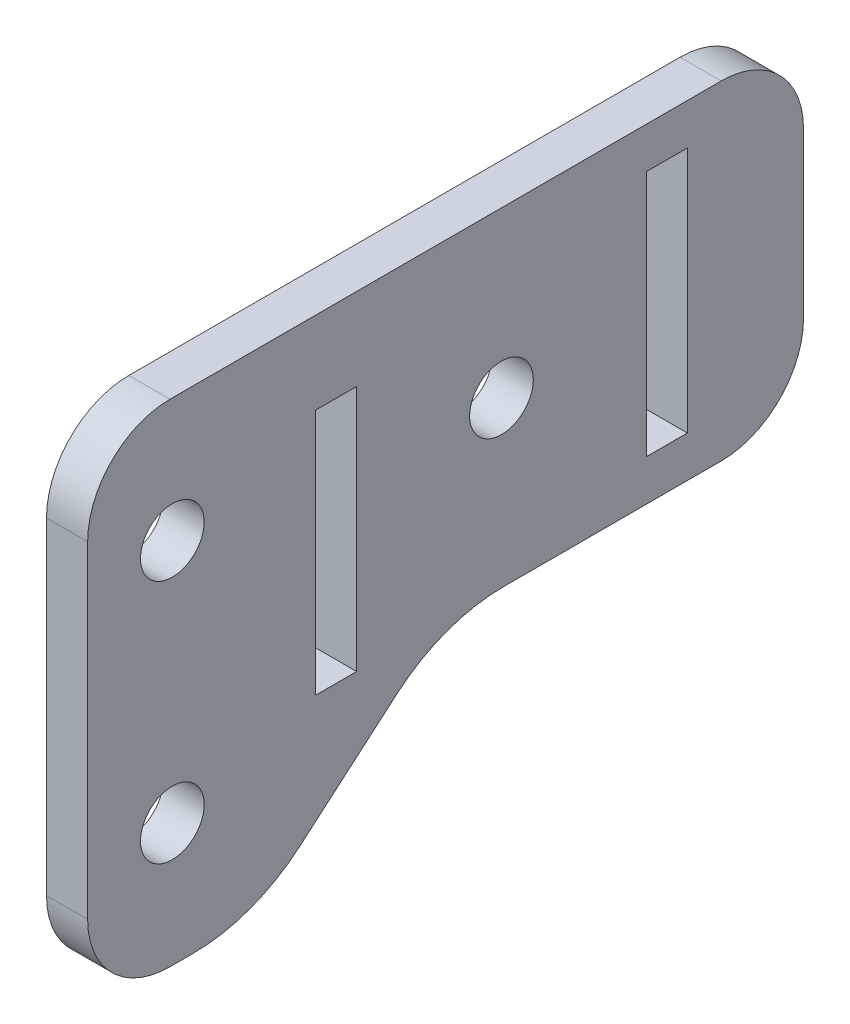
ISO-10303-21;
HEADER;
FILE_DESCRIPTION(('STEP AP214'),'2;1');
FILE_NAME('part.step','',(''),(''),'','','');
FILE_SCHEMA(('AUTOMOTIVE_DESIGN { 1 0 10303 214 1 1 1 1 }'));
ENDSEC;
DATA;
#1=APPLICATION_CONTEXT('core data for automotive mechanical design processes');
#2=APPLICATION_PROTOCOL_DEFINITION('international standard','automotive_design',2000,#1);
#3=PRODUCT_CONTEXT('',#1,'mechanical');
#4=PRODUCT('Part','Part','',(#3));
#5=PRODUCT_RELATED_PRODUCT_CATEGORY('part','',(#4));
#6=PRODUCT_DEFINITION_FORMATION('','',#4);
#7=PRODUCT_DEFINITION_CONTEXT('part definition',#1,'design');
#8=PRODUCT_DEFINITION('design','',#6,#7);
#9=PRODUCT_DEFINITION_SHAPE('','',#8);
#10=(LENGTH_UNIT() NAMED_UNIT(*) SI_UNIT(.MILLI.,.METRE.));
#11=(NAMED_UNIT(*) PLANE_ANGLE_UNIT() SI_UNIT($,.RADIAN.));
#12=(NAMED_UNIT(*) SI_UNIT($,.STERADIAN.) SOLID_ANGLE_UNIT());
#13=UNCERTAINTY_MEASURE_WITH_UNIT(LENGTH_MEASURE(1.E-05),#10,'distance_accuracy_value','');
#14=(GEOMETRIC_REPRESENTATION_CONTEXT(3) GLOBAL_UNCERTAINTY_ASSIGNED_CONTEXT((#13)) GLOBAL_UNIT_ASSIGNED_CONTEXT((#10,
#11,#12)) REPRESENTATION_CONTEXT('',''));
#15=CARTESIAN_POINT('',(0.,0.,0.));
#16=DIRECTION('',(0.,0.,1.));
#17=DIRECTION('',(1.,0.,0.));
#18=AXIS2_PLACEMENT_3D('',#15,#16,#17);
#19=CARTESIAN_POINT('',(3.175,17.2156788351446,31.9348602919418));
#20=DIRECTION('',(0.,0.,-1.));
#21=DIRECTION('',(0.,1.,0.));
#22=AXIS2_PLACEMENT_3D('',#19,#20,#21);
#23=PLANE('',#22);
#24=DIRECTION('',(0.,-1.,0.));
#25=VECTOR('',#24,1.);
#26=CARTESIAN_POINT('',(0.,17.2156788351446,31.9348602919418));
#27=LINE('',#26,#25);
#28=CARTESIAN_POINT('',(0.,10.8656788351446,31.9348602919418));
#29=VERTEX_POINT('',#28);
#30=CARTESIAN_POINT('',(0.,-14.3666811648554,31.9348602919418));
#31=VERTEX_POINT('',#30);
#32=EDGE_CURVE('E218',#29,#31,#27,.T.);
#33=ORIENTED_EDGE('',*,*,#32,.T.);
#34=DIRECTION('',(-1.,0.,0.));
#35=VECTOR('',#34,1.);
#36=CARTESIAN_POINT('',(3.175,-14.3666811648554,31.9348602919418));
#37=LINE('',#36,#35);
#38=CARTESIAN_POINT('',(3.175,-14.3666811648554,31.9348602919418));
#39=VERTEX_POINT('',#38);
#40=EDGE_CURVE('E11',#31,#39,#37,.F.);
#41=ORIENTED_EDGE('',*,*,#40,.T.);
#42=DIRECTION('',(0.,-1.,0.));
#43=VECTOR('',#42,1.);
#44=CARTESIAN_POINT('',(3.175,17.2156788351446,31.9348602919418));
#45=LINE('',#44,#43);
#46=CARTESIAN_POINT('',(3.175,10.8656788351446,31.9348602919418));
#47=VERTEX_POINT('',#46);
#48=EDGE_CURVE('E253',#47,#39,#45,.T.);
#49=ORIENTED_EDGE('',*,*,#48,.F.);
#50=DIRECTION('',(-1.,0.,0.));
#51=VECTOR('',#50,1.);
#52=CARTESIAN_POINT('',(3.175,10.8656788351446,31.9348602919418));
#53=LINE('',#52,#51);
#54=EDGE_CURVE('E43',#47,#29,#53,.T.);
#55=ORIENTED_EDGE('',*,*,#54,.T.);
#56=EDGE_LOOP('',(#33,#41,#49,#55));
#57=FACE_BOUND('',#56,.T.);
#58=ADVANCED_FACE('F35',(#57),#23,.F.);
#59=CARTESIAN_POINT('',(3.175,-20.7166811648554,23.8154632165909));
#60=DIRECTION('',(0.,1.,0.));
#61=DIRECTION('',(0.,0.,1.));
#62=AXIS2_PLACEMENT_3D('',#59,#60,#61);
#63=PLANE('',#62);
#64=DIRECTION('',(0.,0.,-1.));
#65=VECTOR('',#64,1.);
#66=CARTESIAN_POINT('',(3.175,-20.7166811648554,23.8154632165909));
#67=LINE('',#66,#65);
#68=CARTESIAN_POINT('',(3.175,-20.7166811648554,25.5848602919418));
#69=VERTEX_POINT('',#68);
#70=CARTESIAN_POINT('',(3.175,-20.7166811648554,23.8154632165909));
#71=VERTEX_POINT('',#70);
#72=EDGE_CURVE('E255',#69,#71,#67,.T.);
#73=ORIENTED_EDGE('',*,*,#72,.F.);
#74=DIRECTION('',(-1.,0.,0.));
#75=VECTOR('',#74,1.);
#76=CARTESIAN_POINT('',(3.175,-20.7166811648554,25.5848602919418));
#77=LINE('',#76,#75);
#78=CARTESIAN_POINT('',(0.,-20.7166811648554,25.5848602919418));
#79=VERTEX_POINT('',#78);
#80=EDGE_CURVE('E327',#69,#79,#77,.T.);
#81=ORIENTED_EDGE('',*,*,#80,.T.);
#82=DIRECTION('',(0.,0.,-1.));
#83=VECTOR('',#82,1.);
#84=CARTESIAN_POINT('',(0.,-20.7166811648554,23.8154632165909));
#85=LINE('',#84,#83);
#86=CARTESIAN_POINT('',(0.,-20.7166811648554,23.8154632165909));
#87=VERTEX_POINT('',#86);
#88=EDGE_CURVE('E275',#79,#87,#85,.T.);
#89=ORIENTED_EDGE('',*,*,#88,.T.);
#90=DIRECTION('',(-1.,0.,0.));
#91=VECTOR('',#90,1.);
#92=CARTESIAN_POINT('',(3.175,-20.7166811648554,23.8154632165909));
#93=LINE('',#92,#91);
#94=EDGE_CURVE('E298',#71,#87,#93,.T.);
#95=ORIENTED_EDGE('',*,*,#94,.F.);
#96=EDGE_LOOP('',(#73,#81,#89,#95));
#97=FACE_BOUND('',#96,.T.);
#98=ADVANCED_FACE('F346',(#97),#63,.F.);
#99=CARTESIAN_POINT('',(3.175,-8.01668116485543,23.8154632165909));
#100=DIRECTION('',(-1.,0.,0.));
#101=DIRECTION('',(0.,0.,1.));
#102=AXIS2_PLACEMENT_3D('',#99,#100,#101);
#103=CYLINDRICAL_SURFACE('',#102,12.7);
#104=CARTESIAN_POINT('',(0.,-8.01668116485543,23.8154632165909));
#105=DIRECTION('',(1.,0.,0.));
#106=DIRECTION('',(0.,0.,-1.));
#107=AXIS2_PLACEMENT_3D('',#104,#105,#106);
#108=CIRCLE('',#107,12.7);
#109=CARTESIAN_POINT('',(0.,-17.6547424695242,15.5451685248978));
#110=VERTEX_POINT('',#109);
#111=EDGE_CURVE('E277',#87,#110,#108,.T.);
#112=ORIENTED_EDGE('',*,*,#111,.T.);
#113=DIRECTION('',(-1.,0.,0.));
#114=VECTOR('',#113,1.);
#115=CARTESIAN_POINT('',(3.175,-17.6547424695242,15.5451685248978));
#116=LINE('',#115,#114);
#117=CARTESIAN_POINT('',(3.175,-17.6547424695242,15.5451685248978));
#118=VERTEX_POINT('',#117);
#119=EDGE_CURVE('E295',#118,#110,#116,.T.);
#120=ORIENTED_EDGE('',*,*,#119,.F.);
#121=CARTESIAN_POINT('',(3.175,-8.01668116485543,23.8154632165909));
#122=DIRECTION('',(1.,0.,0.));
#123=DIRECTION('',(0.,0.,-1.));
#124=AXIS2_PLACEMENT_3D('',#121,#122,#123);
#125=CIRCLE('',#124,12.7);
#126=EDGE_CURVE('E258',#71,#118,#125,.T.);
#127=ORIENTED_EDGE('',*,*,#126,.F.);
#128=ORIENTED_EDGE('',*,*,#94,.T.);
#129=EDGE_LOOP('',(#112,#120,#127,#128));
#130=FACE_BOUND('',#129,.T.);
#131=ADVANCED_FACE('F353',(#130),#103,.T.);
#132=CARTESIAN_POINT('',(3.175,-11.2462598601867,8.07683147510241));
#133=DIRECTION('',(0.,0.758902464934545,0.651204306432529));
#134=DIRECTION('',(0.,-0.651204306432529,0.758902464934545));
#135=AXIS2_PLACEMENT_3D('',#132,#133,#134);
#136=PLANE('',#135);
#137=DIRECTION('',(0.,0.651204306432529,-0.758902464934545));
#138=VECTOR('',#137,1.);
#139=CARTESIAN_POINT('',(0.,-11.2462598601867,8.07683147510241));
#140=LINE('',#139,#138);
#141=CARTESIAN_POINT('',(0.,-11.2462598601867,8.07683147510241));
#142=VERTEX_POINT('',#141);
#143=EDGE_CURVE('E279',#110,#142,#140,.T.);
#144=ORIENTED_EDGE('',*,*,#143,.T.);
#145=DIRECTION('',(-1.,0.,0.));
#146=VECTOR('',#145,1.);
#147=CARTESIAN_POINT('',(3.175,-11.2462598601867,8.07683147510241));
#148=LINE('',#147,#146);
#149=CARTESIAN_POINT('',(3.175,-11.2462598601867,8.07683147510241));
#150=VERTEX_POINT('',#149);
#151=EDGE_CURVE('E292',#150,#142,#148,.T.);
#152=ORIENTED_EDGE('',*,*,#151,.F.);
#153=DIRECTION('',(0.,0.651204306432529,-0.758902464934545));
#154=VECTOR('',#153,1.);
#155=CARTESIAN_POINT('',(3.175,-11.2462598601867,8.07683147510241));
#156=LINE('',#155,#154);
#157=EDGE_CURVE('E260',#118,#150,#156,.T.);
#158=ORIENTED_EDGE('',*,*,#157,.F.);
#159=ORIENTED_EDGE('',*,*,#119,.T.);
#160=EDGE_LOOP('',(#144,#152,#158,#159));
#161=FACE_BOUND('',#160,.T.);
#162=ADVANCED_FACE('F356',(#161),#136,.F.);
#163=CARTESIAN_POINT('',(3.175,-20.8843211648554,-0.193463216590709));
#164=DIRECTION('',(-1.,0.,0.));
#165=DIRECTION('',(0.,0.,1.));
#166=AXIS2_PLACEMENT_3D('',#163,#164,#165);
#167=CYLINDRICAL_SURFACE('',#166,12.7);
#168=CARTESIAN_POINT('',(0.,-20.8843211648554,-0.193463216590709));
#169=DIRECTION('',(-1.,0.,0.));
#170=DIRECTION('',(0.,0.,-1.));
#171=AXIS2_PLACEMENT_3D('',#168,#169,#170);
#172=CIRCLE('',#171,12.7);
#173=CARTESIAN_POINT('',(0.,-8.18432116485543,-0.193463216590736));
#174=VERTEX_POINT('',#173);
#175=EDGE_CURVE('E281',#142,#174,#172,.T.);
#176=ORIENTED_EDGE('',*,*,#175,.T.);
#177=DIRECTION('',(-1.,0.,0.));
#178=VECTOR('',#177,1.);
#179=CARTESIAN_POINT('',(3.175,-8.18432116485543,-0.193463216590736));
#180=LINE('',#179,#178);
#181=CARTESIAN_POINT('',(3.175,-8.18432116485543,-0.193463216590736));
#182=VERTEX_POINT('',#181);
#183=EDGE_CURVE('E272',#182,#174,#180,.T.);
#184=ORIENTED_EDGE('',*,*,#183,.F.);
#185=CARTESIAN_POINT('',(3.175,-20.8843211648554,-0.193463216590709));
#186=DIRECTION('',(-1.,0.,0.));
#187=DIRECTION('',(0.,0.,-1.));
#188=AXIS2_PLACEMENT_3D('',#185,#186,#187);
#189=CIRCLE('',#188,12.7);
#190=EDGE_CURVE('E262',#150,#182,#189,.T.);
#191=ORIENTED_EDGE('',*,*,#190,.F.);
#192=ORIENTED_EDGE('',*,*,#151,.T.);
#193=EDGE_LOOP('',(#176,#184,#191,#192));
#194=FACE_BOUND('',#193,.T.);
#195=ADVANCED_FACE('F361',(#194),#167,.F.);
#196=CARTESIAN_POINT('',(3.175,-8.18432116485543,-23.3101397080582));
#197=DIRECTION('',(0.,1.,0.));
#198=DIRECTION('',(0.,0.,1.));
#199=AXIS2_PLACEMENT_3D('',#196,#197,#198);
#200=PLANE('',#199);
#201=DIRECTION('',(0.,0.,-1.));
#202=VECTOR('',#201,1.);
#203=CARTESIAN_POINT('',(0.,-8.18432116485543,-23.3101397080582));
#204=LINE('',#203,#202);
#205=CARTESIAN_POINT('',(0.,-8.18432116485543,-16.9601397080582));
#206=VERTEX_POINT('',#205);
#207=EDGE_CURVE('E283',#174,#206,#204,.T.);
#208=ORIENTED_EDGE('',*,*,#207,.T.);
#209=DIRECTION('',(-1.,0.,0.));
#210=VECTOR('',#209,1.);
#211=CARTESIAN_POINT('',(3.175,-8.18432116485543,-16.9601397080582));
#212=LINE('',#211,#210);
#213=CARTESIAN_POINT('',(3.175,-8.18432116485543,-16.9601397080582));
#214=VERTEX_POINT('',#213);
#215=EDGE_CURVE('E50',#206,#214,#212,.F.);
#216=ORIENTED_EDGE('',*,*,#215,.T.);
#217=DIRECTION('',(0.,0.,-1.));
#218=VECTOR('',#217,1.);
#219=CARTESIAN_POINT('',(3.175,-8.18432116485543,-23.3101397080582));
#220=LINE('',#219,#218);
#221=EDGE_CURVE('E264',#182,#214,#220,.T.);
#222=ORIENTED_EDGE('',*,*,#221,.F.);
#223=ORIENTED_EDGE('',*,*,#183,.T.);
#224=EDGE_LOOP('',(#208,#216,#222,#223));
#225=FACE_BOUND('',#224,.T.);
#226=ADVANCED_FACE('F542',(#225),#200,.F.);
#227=CARTESIAN_POINT('',(3.175,-8.18432116485543,-23.3101397080582));
#228=DIRECTION('',(0.,0.,1.));
#229=DIRECTION('',(1.,0.,0.));
#230=AXIS2_PLACEMENT_3D('',#227,#228,#229);
#231=PLANE('',#230);
#232=DIRECTION('',(0.,1.,0.));
#233=VECTOR('',#232,1.);
#234=CARTESIAN_POINT('',(0.,-8.18432116485543,-23.3101397080582));
#235=LINE('',#234,#233);
#236=CARTESIAN_POINT('',(0.,-1.83432116485543,-23.3101397080582));
#237=VERTEX_POINT('',#236);
#238=CARTESIAN_POINT('',(0.,10.8656788351446,-23.3101397080582));
#239=VERTEX_POINT('',#238);
#240=EDGE_CURVE('E285',#237,#239,#235,.T.);
#241=ORIENTED_EDGE('',*,*,#240,.T.);
#242=DIRECTION('',(-1.,0.,0.));
#243=VECTOR('',#242,1.);
#244=CARTESIAN_POINT('',(3.175,10.8656788351446,-23.3101397080582));
#245=LINE('',#244,#243);
#246=CARTESIAN_POINT('',(3.175,10.8656788351446,-23.3101397080582));
#247=VERTEX_POINT('',#246);
#248=EDGE_CURVE('E317',#239,#247,#245,.F.);
#249=ORIENTED_EDGE('',*,*,#248,.T.);
#250=DIRECTION('',(0.,1.,0.));
#251=VECTOR('',#250,1.);
#252=CARTESIAN_POINT('',(3.175,-8.18432116485543,-23.3101397080582));
#253=LINE('',#252,#251);
#254=CARTESIAN_POINT('',(3.175,-1.83432116485543,-23.3101397080582));
#255=VERTEX_POINT('',#254);
#256=EDGE_CURVE('E266',#255,#247,#253,.T.);
#257=ORIENTED_EDGE('',*,*,#256,.F.);
#258=DIRECTION('',(-1.,0.,0.));
#259=VECTOR('',#258,1.);
#260=CARTESIAN_POINT('',(3.175,-1.83432116485543,-23.3101397080582));
#261=LINE('',#260,#259);
#262=EDGE_CURVE('E314',#255,#237,#261,.T.);
#263=ORIENTED_EDGE('',*,*,#262,.T.);
#264=EDGE_LOOP('',(#241,#249,#257,#263));
#265=FACE_BOUND('',#264,.T.);
#266=ADVANCED_FACE('F369',(#265),#231,.F.);
#267=CARTESIAN_POINT('',(3.175,17.2156788351446,31.9348602919418));
#268=DIRECTION('',(0.,-1.,0.));
#269=DIRECTION('',(0.,0.,-1.));
#270=AXIS2_PLACEMENT_3D('',#267,#268,#269);
#271=PLANE('',#270);
#272=DIRECTION('',(0.,0.,1.));
#273=VECTOR('',#272,1.);
#274=CARTESIAN_POINT('',(3.175,17.2156788351446,31.9348602919418));
#275=LINE('',#274,#273);
#276=CARTESIAN_POINT('',(3.175,17.2156788351446,-16.9601397080582));
#277=VERTEX_POINT('',#276);
#278=CARTESIAN_POINT('',(3.175,17.2156788351446,25.5848602919418));
#279=VERTEX_POINT('',#278);
#280=EDGE_CURVE('E269',#277,#279,#275,.T.);
#281=ORIENTED_EDGE('',*,*,#280,.F.);
#282=DIRECTION('',(-1.,0.,0.));
#283=VECTOR('',#282,1.);
#284=CARTESIAN_POINT('',(3.175,17.2156788351446,-16.9601397080582));
#285=LINE('',#284,#283);
#286=CARTESIAN_POINT('',(0.,17.2156788351446,-16.9601397080582));
#287=VERTEX_POINT('',#286);
#288=EDGE_CURVE('E303',#277,#287,#285,.T.);
#289=ORIENTED_EDGE('',*,*,#288,.T.);
#290=DIRECTION('',(0.,0.,1.));
#291=VECTOR('',#290,1.);
#292=CARTESIAN_POINT('',(0.,17.2156788351446,31.9348602919418));
#293=LINE('',#292,#291);
#294=CARTESIAN_POINT('',(0.,17.2156788351446,25.5848602919418));
#295=VERTEX_POINT('',#294);
#296=EDGE_CURVE('E256',#287,#295,#293,.T.);
#297=ORIENTED_EDGE('',*,*,#296,.T.);
#298=DIRECTION('',(-1.,0.,0.));
#299=VECTOR('',#298,1.);
#300=CARTESIAN_POINT('',(3.175,17.2156788351446,25.5848602919418));
#301=LINE('',#300,#299);
#302=EDGE_CURVE('E301',#295,#279,#301,.F.);
#303=ORIENTED_EDGE('',*,*,#302,.T.);
#304=EDGE_LOOP('',(#281,#289,#297,#303));
#305=FACE_BOUND('',#304,.T.);
#306=ADVANCED_FACE('F378',(#305),#271,.F.);
#307=CARTESIAN_POINT('',(3.175,-8.01668116485543,23.8154632165909));
#308=DIRECTION('',(1.,0.,0.));
#309=DIRECTION('',(0.,0.,-1.));
#310=AXIS2_PLACEMENT_3D('',#307,#308,#309);
#311=PLANE('',#310);
#312=CARTESIAN_POINT('',(3.175,7.69067883514458,25.4));
#313=DIRECTION('',(1.,0.,0.));
#314=DIRECTION('',(0.,0.,-1.));
#315=AXIS2_PLACEMENT_3D('',#312,#313,#314);
#316=CIRCLE('',#315,2.45744999999999);
#317=CARTESIAN_POINT('',(3.175,7.69067883514458,22.94255));
#318=VERTEX_POINT('',#317);
#319=EDGE_CURVE('E602',#318,#318,#316,.T.);
#320=ORIENTED_EDGE('',*,*,#319,.F.);
#321=EDGE_LOOP('',(#320));
#322=FACE_BOUND('',#321,.T.);
#323=CARTESIAN_POINT('',(3.175,-11.1916811648554,25.4));
#324=DIRECTION('',(1.,0.,0.));
#325=DIRECTION('',(0.,0.,-1.));
#326=AXIS2_PLACEMENT_3D('',#323,#324,#325);
#327=CIRCLE('',#326,2.45744999999999);
#328=CARTESIAN_POINT('',(3.175,-11.1916811648554,22.94255));
#329=VERTEX_POINT('',#328);
#330=EDGE_CURVE('E606',#329,#329,#327,.T.);
#331=ORIENTED_EDGE('',*,*,#330,.F.);
#332=EDGE_LOOP('',(#331));
#333=FACE_BOUND('',#332,.T.);
#334=CARTESIAN_POINT('',(3.175,4.51567883514458,0.));
#335=DIRECTION('',(1.,0.,0.));
#336=DIRECTION('',(0.,0.,-1.));
#337=AXIS2_PLACEMENT_3D('',#334,#335,#336);
#338=CIRCLE('',#337,2.45744999999999);
#339=CARTESIAN_POINT('',(3.175,4.51567883514458,-2.45744999999999));
#340=VERTEX_POINT('',#339);
#341=EDGE_CURVE('E205',#340,#340,#338,.T.);
#342=ORIENTED_EDGE('',*,*,#341,.F.);
#343=EDGE_LOOP('',(#342));
#344=FACE_BOUND('',#343,.T.);
#345=DIRECTION('',(0.,1.,0.));
#346=VECTOR('',#345,1.);
#347=CARTESIAN_POINT('',(3.175,14.0406788351446,-11.176));
#348=LINE('',#347,#346);
#349=CARTESIAN_POINT('',(3.175,-5.00932116485543,-11.176));
#350=VERTEX_POINT('',#349);
#351=CARTESIAN_POINT('',(3.175,14.0406788351446,-11.176));
#352=VERTEX_POINT('',#351);
#353=EDGE_CURVE('E178',#350,#352,#348,.T.);
#354=ORIENTED_EDGE('',*,*,#353,.T.);
#355=DIRECTION('',(0.,0.,-1.));
#356=VECTOR('',#355,1.);
#357=CARTESIAN_POINT('',(3.175,14.0406788351446,-11.176));
#358=LINE('',#357,#356);
#359=CARTESIAN_POINT('',(3.175,14.0406788351446,-14.351));
#360=VERTEX_POINT('',#359);
#361=EDGE_CURVE('E190',#352,#360,#358,.T.);
#362=ORIENTED_EDGE('',*,*,#361,.T.);
#363=DIRECTION('',(0.,-1.,0.));
#364=VECTOR('',#363,1.);
#365=CARTESIAN_POINT('',(3.175,-5.00932116485543,-14.351));
#366=LINE('',#365,#364);
#367=CARTESIAN_POINT('',(3.175,-5.00932116485543,-14.351));
#368=VERTEX_POINT('',#367);
#369=EDGE_CURVE('E194',#360,#368,#366,.T.);
#370=ORIENTED_EDGE('',*,*,#369,.T.);
#371=DIRECTION('',(0.,0.,1.));
#372=VECTOR('',#371,1.);
#373=CARTESIAN_POINT('',(3.175,-5.00932116485543,-11.176));
#374=LINE('',#373,#372);
#375=EDGE_CURVE('E186',#368,#350,#374,.T.);
#376=ORIENTED_EDGE('',*,*,#375,.T.);
#377=EDGE_LOOP('',(#354,#362,#370,#376));
#378=FACE_BOUND('',#377,.T.);
#379=DIRECTION('',(0.,1.,0.));
#380=VECTOR('',#379,1.);
#381=CARTESIAN_POINT('',(3.175,-8.18432116485535,14.351));
#382=LINE('',#381,#380);
#383=CARTESIAN_POINT('',(3.175,-8.18432116485535,14.351));
#384=VERTEX_POINT('',#383);
#385=CARTESIAN_POINT('',(3.175,10.8656788351446,14.351));
#386=VERTEX_POINT('',#385);
#387=EDGE_CURVE('E222',#384,#386,#382,.T.);
#388=ORIENTED_EDGE('',*,*,#387,.T.);
#389=DIRECTION('',(0.,0.,-1.));
#390=VECTOR('',#389,1.);
#391=CARTESIAN_POINT('',(3.175,10.8656788351446,14.351));
#392=LINE('',#391,#390);
#393=CARTESIAN_POINT('',(3.175,10.8656788351446,11.176));
#394=VERTEX_POINT('',#393);
#395=EDGE_CURVE('E225',#386,#394,#392,.T.);
#396=ORIENTED_EDGE('',*,*,#395,.T.);
#397=DIRECTION('',(0.,-1.,0.));
#398=VECTOR('',#397,1.);
#399=CARTESIAN_POINT('',(3.175,10.8656788351446,11.176));
#400=LINE('',#399,#398);
#401=CARTESIAN_POINT('',(3.175,-8.18432116485535,11.176));
#402=VERTEX_POINT('',#401);
#403=EDGE_CURVE('E229',#394,#402,#400,.T.);
#404=ORIENTED_EDGE('',*,*,#403,.T.);
#405=DIRECTION('',(0.,0.,1.));
#406=VECTOR('',#405,1.);
#407=CARTESIAN_POINT('',(3.175,-8.18432116485535,11.176));
#408=LINE('',#407,#406);
#409=EDGE_CURVE('E232',#402,#384,#408,.T.);
#410=ORIENTED_EDGE('',*,*,#409,.T.);
#411=EDGE_LOOP('',(#388,#396,#404,#410));
#412=FACE_BOUND('',#411,.T.);
#413=ORIENTED_EDGE('',*,*,#256,.T.);
#414=CARTESIAN_POINT('',(3.175,10.8656788351446,-16.9601397080582));
#415=DIRECTION('',(1.,0.,0.));
#416=DIRECTION('',(0.,0.,-1.));
#417=AXIS2_PLACEMENT_3D('',#414,#415,#416);
#418=CIRCLE('',#417,6.35);
#419=EDGE_CURVE('E324',#247,#277,#418,.T.);
#420=ORIENTED_EDGE('',*,*,#419,.T.);
#421=ORIENTED_EDGE('',*,*,#280,.T.);
#422=CARTESIAN_POINT('',(3.175,10.8656788351446,25.5848602919418));
#423=DIRECTION('',(1.,0.,0.));
#424=DIRECTION('',(0.,0.,-1.));
#425=AXIS2_PLACEMENT_3D('',#422,#423,#424);
#426=CIRCLE('',#425,6.35);
#427=EDGE_CURVE('E319',#279,#47,#426,.T.);
#428=ORIENTED_EDGE('',*,*,#427,.T.);
#429=ORIENTED_EDGE('',*,*,#48,.T.);
#430=CARTESIAN_POINT('',(3.175,-14.3666811648554,25.5848602919418));
#431=DIRECTION('',(1.,0.,0.));
#432=DIRECTION('',(0.,0.,-1.));
#433=AXIS2_PLACEMENT_3D('',#430,#431,#432);
#434=CIRCLE('',#433,6.35);
#435=EDGE_CURVE('E58',#39,#69,#434,.T.);
#436=ORIENTED_EDGE('',*,*,#435,.T.);
#437=ORIENTED_EDGE('',*,*,#72,.T.);
#438=ORIENTED_EDGE('',*,*,#126,.T.);
#439=ORIENTED_EDGE('',*,*,#157,.T.);
#440=ORIENTED_EDGE('',*,*,#190,.T.);
#441=ORIENTED_EDGE('',*,*,#221,.T.);
#442=CARTESIAN_POINT('',(3.175,-1.83432116485543,-16.9601397080582));
#443=DIRECTION('',(1.,0.,0.));
#444=DIRECTION('',(0.,0.,-1.));
#445=AXIS2_PLACEMENT_3D('',#442,#443,#444);
#446=CIRCLE('',#445,6.35);
#447=EDGE_CURVE('E322',#214,#255,#446,.T.);
#448=ORIENTED_EDGE('',*,*,#447,.T.);
#449=EDGE_LOOP('',(#413,#420,#421,#428,#429,#436,#437,#438,#439,#440,#441,#448));
#450=FACE_BOUND('',#449,.T.);
#451=ADVANCED_FACE('F196',(#322,#333,#344,#378,#412,#450),#311,.T.);
#452=CARTESIAN_POINT('',(0.,-8.01668116485543,23.8154632165909));
#453=DIRECTION('',(1.,0.,0.));
#454=DIRECTION('',(0.,0.,-1.));
#455=AXIS2_PLACEMENT_3D('',#452,#453,#454);
#456=PLANE('',#455);
#457=CARTESIAN_POINT('',(0.,7.69067883514458,25.4));
#458=DIRECTION('',(-1.,0.,0.));
#459=DIRECTION('',(0.,0.,1.));
#460=AXIS2_PLACEMENT_3D('',#457,#458,#459);
#461=CIRCLE('',#460,2.45744999999999);
#462=CARTESIAN_POINT('',(0.,7.69067883514458,27.85745));
#463=VERTEX_POINT('',#462);
#464=EDGE_CURVE('E619',#463,#463,#461,.T.);
#465=ORIENTED_EDGE('',*,*,#464,.F.);
#466=EDGE_LOOP('',(#465));
#467=FACE_BOUND('',#466,.T.);
#468=CARTESIAN_POINT('',(0.,-11.1916811648554,25.4));
#469=DIRECTION('',(-1.,0.,0.));
#470=DIRECTION('',(0.,0.,1.));
#471=AXIS2_PLACEMENT_3D('',#468,#469,#470);
#472=CIRCLE('',#471,2.45744999999999);
#473=CARTESIAN_POINT('',(0.,-11.1916811648554,27.85745));
#474=VERTEX_POINT('',#473);
#475=EDGE_CURVE('E613',#474,#474,#472,.T.);
#476=ORIENTED_EDGE('',*,*,#475,.F.);
#477=EDGE_LOOP('',(#476));
#478=FACE_BOUND('',#477,.T.);
#479=CARTESIAN_POINT('',(0.,4.51567883514458,0.));
#480=DIRECTION('',(-1.,0.,0.));
#481=DIRECTION('',(0.,0.,1.));
#482=AXIS2_PLACEMENT_3D('',#479,#480,#481);
#483=CIRCLE('',#482,2.45744999999999);
#484=CARTESIAN_POINT('',(0.,4.51567883514458,2.45744999999999));
#485=VERTEX_POINT('',#484);
#486=EDGE_CURVE('E609',#485,#485,#483,.T.);
#487=ORIENTED_EDGE('',*,*,#486,.F.);
#488=EDGE_LOOP('',(#487));
#489=FACE_BOUND('',#488,.T.);
#490=DIRECTION('',(0.,0.,-1.));
#491=VECTOR('',#490,1.);
#492=CARTESIAN_POINT('',(0.,14.0406788351446,-11.176));
#493=LINE('',#492,#491);
#494=CARTESIAN_POINT('',(0.,14.0406788351446,-11.176));
#495=VERTEX_POINT('',#494);
#496=CARTESIAN_POINT('',(0.,14.0406788351446,-14.351));
#497=VERTEX_POINT('',#496);
#498=EDGE_CURVE('E211',#495,#497,#493,.T.);
#499=ORIENTED_EDGE('',*,*,#498,.F.);
#500=DIRECTION('',(0.,1.,0.));
#501=VECTOR('',#500,1.);
#502=CARTESIAN_POINT('',(0.,14.0406788351446,-11.176));
#503=LINE('',#502,#501);
#504=CARTESIAN_POINT('',(0.,-5.00932116485543,-11.176));
#505=VERTEX_POINT('',#504);
#506=EDGE_CURVE('E181',#505,#495,#503,.T.);
#507=ORIENTED_EDGE('',*,*,#506,.F.);
#508=DIRECTION('',(0.,0.,1.));
#509=VECTOR('',#508,1.);
#510=CARTESIAN_POINT('',(0.,-5.00932116485543,-11.176));
#511=LINE('',#510,#509);
#512=CARTESIAN_POINT('',(0.,-5.00932116485543,-14.351));
#513=VERTEX_POINT('',#512);
#514=EDGE_CURVE('E199',#513,#505,#511,.T.);
#515=ORIENTED_EDGE('',*,*,#514,.F.);
#516=DIRECTION('',(0.,-1.,0.));
#517=VECTOR('',#516,1.);
#518=CARTESIAN_POINT('',(0.,-5.00932116485543,-14.351));
#519=LINE('',#518,#517);
#520=EDGE_CURVE('E202',#497,#513,#519,.T.);
#521=ORIENTED_EDGE('',*,*,#520,.F.);
#522=EDGE_LOOP('',(#499,#507,#515,#521));
#523=FACE_BOUND('',#522,.T.);
#524=DIRECTION('',(0.,0.,-1.));
#525=VECTOR('',#524,1.);
#526=CARTESIAN_POINT('',(0.,10.8656788351446,14.351));
#527=LINE('',#526,#525);
#528=CARTESIAN_POINT('',(0.,10.8656788351446,14.351));
#529=VERTEX_POINT('',#528);
#530=CARTESIAN_POINT('',(0.,10.8656788351446,11.176));
#531=VERTEX_POINT('',#530);
#532=EDGE_CURVE('E238',#529,#531,#527,.T.);
#533=ORIENTED_EDGE('',*,*,#532,.F.);
#534=DIRECTION('',(0.,1.,0.));
#535=VECTOR('',#534,1.);
#536=CARTESIAN_POINT('',(0.,-8.18432116485535,14.351));
#537=LINE('',#536,#535);
#538=CARTESIAN_POINT('',(0.,-8.18432116485535,14.351));
#539=VERTEX_POINT('',#538);
#540=EDGE_CURVE('E236',#539,#529,#537,.T.);
#541=ORIENTED_EDGE('',*,*,#540,.F.);
#542=DIRECTION('',(0.,0.,1.));
#543=VECTOR('',#542,1.);
#544=CARTESIAN_POINT('',(0.,-8.18432116485535,11.176));
#545=LINE('',#544,#543);
#546=CARTESIAN_POINT('',(0.,-8.18432116485535,11.176));
#547=VERTEX_POINT('',#546);
#548=EDGE_CURVE('E226',#547,#539,#545,.T.);
#549=ORIENTED_EDGE('',*,*,#548,.F.);
#550=DIRECTION('',(0.,-1.,0.));
#551=VECTOR('',#550,1.);
#552=CARTESIAN_POINT('',(0.,10.8656788351446,11.176));
#553=LINE('',#552,#551);
#554=EDGE_CURVE('E241',#531,#547,#553,.T.);
#555=ORIENTED_EDGE('',*,*,#554,.F.);
#556=EDGE_LOOP('',(#533,#541,#549,#555));
#557=FACE_BOUND('',#556,.T.);
#558=ORIENTED_EDGE('',*,*,#296,.F.);
#559=CARTESIAN_POINT('',(0.,10.8656788351446,-16.9601397080582));
#560=DIRECTION('',(1.,0.,0.));
#561=DIRECTION('',(0.,0.,-1.));
#562=AXIS2_PLACEMENT_3D('',#559,#560,#561);
#563=CIRCLE('',#562,6.35);
#564=EDGE_CURVE('E312',#287,#239,#563,.F.);
#565=ORIENTED_EDGE('',*,*,#564,.T.);
#566=ORIENTED_EDGE('',*,*,#240,.F.);
#567=CARTESIAN_POINT('',(0.,-1.83432116485543,-16.9601397080582));
#568=DIRECTION('',(1.,0.,0.));
#569=DIRECTION('',(0.,0.,-1.));
#570=AXIS2_PLACEMENT_3D('',#567,#568,#569);
#571=CIRCLE('',#570,6.35);
#572=EDGE_CURVE('E310',#237,#206,#571,.F.);
#573=ORIENTED_EDGE('',*,*,#572,.T.);
#574=ORIENTED_EDGE('',*,*,#207,.F.);
#575=ORIENTED_EDGE('',*,*,#175,.F.);
#576=ORIENTED_EDGE('',*,*,#143,.F.);
#577=ORIENTED_EDGE('',*,*,#111,.F.);
#578=ORIENTED_EDGE('',*,*,#88,.F.);
#579=CARTESIAN_POINT('',(0.,-14.3666811648554,25.5848602919418));
#580=DIRECTION('',(1.,0.,0.));
#581=DIRECTION('',(0.,0.,-1.));
#582=AXIS2_PLACEMENT_3D('',#579,#580,#581);
#583=CIRCLE('',#582,6.35);
#584=EDGE_CURVE('E308',#79,#31,#583,.F.);
#585=ORIENTED_EDGE('',*,*,#584,.T.);
#586=ORIENTED_EDGE('',*,*,#32,.F.);
#587=CARTESIAN_POINT('',(0.,10.8656788351446,25.5848602919418));
#588=DIRECTION('',(1.,0.,0.));
#589=DIRECTION('',(0.,0.,-1.));
#590=AXIS2_PLACEMENT_3D('',#587,#588,#589);
#591=CIRCLE('',#590,6.35);
#592=EDGE_CURVE('E306',#29,#295,#591,.F.);
#593=ORIENTED_EDGE('',*,*,#592,.T.);
#594=EDGE_LOOP('',(#558,#565,#566,#573,#574,#575,#576,#577,#578,#585,#586,#593));
#595=FACE_BOUND('',#594,.T.);
#596=ADVANCED_FACE('F339',(#467,#478,#489,#523,#557,#595),#456,.F.);
#597=CARTESIAN_POINT('',(3.175,-8.18432116485535,14.351));
#598=DIRECTION('',(0.,0.,1.));
#599=DIRECTION('',(0.,-1.,0.));
#600=AXIS2_PLACEMENT_3D('',#597,#598,#599);
#601=PLANE('',#600);
#602=ORIENTED_EDGE('',*,*,#540,.T.);
#603=DIRECTION('',(-1.,0.,0.));
#604=VECTOR('',#603,1.);
#605=CARTESIAN_POINT('',(3.175,10.8656788351446,14.351));
#606=LINE('',#605,#604);
#607=EDGE_CURVE('E235',#386,#529,#606,.T.);
#608=ORIENTED_EDGE('',*,*,#607,.F.);
#609=ORIENTED_EDGE('',*,*,#387,.F.);
#610=DIRECTION('',(-1.,0.,0.));
#611=VECTOR('',#610,1.);
#612=CARTESIAN_POINT('',(3.175,-8.18432116485535,14.351));
#613=LINE('',#612,#611);
#614=EDGE_CURVE('E212',#384,#539,#613,.T.);
#615=ORIENTED_EDGE('',*,*,#614,.T.);
#616=EDGE_LOOP('',(#602,#608,#609,#615));
#617=FACE_BOUND('',#616,.T.);
#618=ADVANCED_FACE('F502',(#617),#601,.F.);
#619=CARTESIAN_POINT('',(3.175,-8.18432116485535,11.176));
#620=DIRECTION('',(0.,-1.,0.));
#621=DIRECTION('',(0.,0.,-1.));
#622=AXIS2_PLACEMENT_3D('',#619,#620,#621);
#623=PLANE('',#622);
#624=ORIENTED_EDGE('',*,*,#548,.T.);
#625=ORIENTED_EDGE('',*,*,#614,.F.);
#626=ORIENTED_EDGE('',*,*,#409,.F.);
#627=DIRECTION('',(-1.,0.,0.));
#628=VECTOR('',#627,1.);
#629=CARTESIAN_POINT('',(3.175,-8.18432116485535,11.176));
#630=LINE('',#629,#628);
#631=EDGE_CURVE('E247',#402,#547,#630,.T.);
#632=ORIENTED_EDGE('',*,*,#631,.T.);
#633=EDGE_LOOP('',(#624,#625,#626,#632));
#634=FACE_BOUND('',#633,.T.);
#635=ADVANCED_FACE('F493',(#634),#623,.F.);
#636=CARTESIAN_POINT('',(3.175,10.8656788351446,11.176));
#637=DIRECTION('',(0.,0.,-1.));
#638=DIRECTION('',(0.,1.,0.));
#639=AXIS2_PLACEMENT_3D('',#636,#637,#638);
#640=PLANE('',#639);
#641=ORIENTED_EDGE('',*,*,#554,.T.);
#642=ORIENTED_EDGE('',*,*,#631,.F.);
#643=ORIENTED_EDGE('',*,*,#403,.F.);
#644=DIRECTION('',(-1.,0.,0.));
#645=VECTOR('',#644,1.);
#646=CARTESIAN_POINT('',(3.175,10.8656788351446,11.176));
#647=LINE('',#646,#645);
#648=EDGE_CURVE('E249',#394,#531,#647,.T.);
#649=ORIENTED_EDGE('',*,*,#648,.T.);
#650=EDGE_LOOP('',(#641,#642,#643,#649));
#651=FACE_BOUND('',#650,.T.);
#652=ADVANCED_FACE('F484',(#651),#640,.F.);
#653=CARTESIAN_POINT('',(3.175,10.8656788351446,14.351));
#654=DIRECTION('',(0.,1.,0.));
#655=DIRECTION('',(0.,0.,1.));
#656=AXIS2_PLACEMENT_3D('',#653,#654,#655);
#657=PLANE('',#656);
#658=ORIENTED_EDGE('',*,*,#532,.T.);
#659=ORIENTED_EDGE('',*,*,#648,.F.);
#660=ORIENTED_EDGE('',*,*,#395,.F.);
#661=ORIENTED_EDGE('',*,*,#607,.T.);
#662=EDGE_LOOP('',(#658,#659,#660,#661));
#663=FACE_BOUND('',#662,.T.);
#664=ADVANCED_FACE('F476',(#663),#657,.F.);
#665=CARTESIAN_POINT('',(3.175,14.0406788351446,-11.176));
#666=DIRECTION('',(0.,0.,1.));
#667=DIRECTION('',(0.,-1.,0.));
#668=AXIS2_PLACEMENT_3D('',#665,#666,#667);
#669=PLANE('',#668);
#670=ORIENTED_EDGE('',*,*,#506,.T.);
#671=DIRECTION('',(-1.,0.,0.));
#672=VECTOR('',#671,1.);
#673=CARTESIAN_POINT('',(3.175,14.0406788351446,-11.176));
#674=LINE('',#673,#672);
#675=EDGE_CURVE('E174',#352,#495,#674,.T.);
#676=ORIENTED_EDGE('',*,*,#675,.F.);
#677=ORIENTED_EDGE('',*,*,#353,.F.);
#678=DIRECTION('',(-1.,0.,0.));
#679=VECTOR('',#678,1.);
#680=CARTESIAN_POINT('',(3.175,-5.00932116485543,-11.176));
#681=LINE('',#680,#679);
#682=EDGE_CURVE('E216',#350,#505,#681,.T.);
#683=ORIENTED_EDGE('',*,*,#682,.T.);
#684=EDGE_LOOP('',(#670,#676,#677,#683));
#685=FACE_BOUND('',#684,.T.);
#686=ADVANCED_FACE('F176',(#685),#669,.F.);
#687=CARTESIAN_POINT('',(3.175,-5.00932116485543,-11.176));
#688=DIRECTION('',(0.,-1.,0.));
#689=DIRECTION('',(0.,0.,-1.));
#690=AXIS2_PLACEMENT_3D('',#687,#688,#689);
#691=PLANE('',#690);
#692=ORIENTED_EDGE('',*,*,#514,.T.);
#693=ORIENTED_EDGE('',*,*,#682,.F.);
#694=ORIENTED_EDGE('',*,*,#375,.F.);
#695=DIRECTION('',(-1.,0.,0.));
#696=VECTOR('',#695,1.);
#697=CARTESIAN_POINT('',(3.175,-5.00932116485543,-14.351));
#698=LINE('',#697,#696);
#699=EDGE_CURVE('E219',#368,#513,#698,.T.);
#700=ORIENTED_EDGE('',*,*,#699,.T.);
#701=EDGE_LOOP('',(#692,#693,#694,#700));
#702=FACE_BOUND('',#701,.T.);
#703=ADVANCED_FACE('F459',(#702),#691,.F.);
#704=CARTESIAN_POINT('',(3.175,-5.00932116485543,-14.351));
#705=DIRECTION('',(0.,0.,-1.));
#706=DIRECTION('',(-1.,0.,0.));
#707=AXIS2_PLACEMENT_3D('',#704,#705,#706);
#708=PLANE('',#707);
#709=ORIENTED_EDGE('',*,*,#520,.T.);
#710=ORIENTED_EDGE('',*,*,#699,.F.);
#711=ORIENTED_EDGE('',*,*,#369,.F.);
#712=DIRECTION('',(-1.,0.,0.));
#713=VECTOR('',#712,1.);
#714=CARTESIAN_POINT('',(3.175,14.0406788351446,-14.351));
#715=LINE('',#714,#713);
#716=EDGE_CURVE('E185',#360,#497,#715,.T.);
#717=ORIENTED_EDGE('',*,*,#716,.T.);
#718=EDGE_LOOP('',(#709,#710,#711,#717));
#719=FACE_BOUND('',#718,.T.);
#720=ADVANCED_FACE('F451',(#719),#708,.F.);
#721=CARTESIAN_POINT('',(3.175,14.0406788351446,-11.176));
#722=DIRECTION('',(0.,1.,0.));
#723=DIRECTION('',(0.,0.,1.));
#724=AXIS2_PLACEMENT_3D('',#721,#722,#723);
#725=PLANE('',#724);
#726=ORIENTED_EDGE('',*,*,#498,.T.);
#727=ORIENTED_EDGE('',*,*,#716,.F.);
#728=ORIENTED_EDGE('',*,*,#361,.F.);
#729=ORIENTED_EDGE('',*,*,#675,.T.);
#730=EDGE_LOOP('',(#726,#727,#728,#729));
#731=FACE_BOUND('',#730,.T.);
#732=ADVANCED_FACE('F191',(#731),#725,.F.);
#733=CARTESIAN_POINT('',(0.,4.51567883514458,0.));
#734=DIRECTION('',(-1.,0.,0.));
#735=DIRECTION('',(0.,0.,1.));
#736=AXIS2_PLACEMENT_3D('',#733,#734,#735);
#737=CYLINDRICAL_SURFACE('',#736,2.45744999999999);
#738=ORIENTED_EDGE('',*,*,#341,.T.);
#739=EDGE_LOOP('',(#738));
#740=FACE_BOUND('',#739,.T.);
#741=ORIENTED_EDGE('',*,*,#486,.T.);
#742=EDGE_LOOP('',(#741));
#743=FACE_BOUND('',#742,.T.);
#744=ADVANCED_FACE('F434',(#740,#743),#737,.F.);
#745=CARTESIAN_POINT('',(0.,-11.1916811648554,25.4));
#746=DIRECTION('',(-1.,0.,0.));
#747=DIRECTION('',(0.,0.,1.));
#748=AXIS2_PLACEMENT_3D('',#745,#746,#747);
#749=CYLINDRICAL_SURFACE('',#748,2.45744999999999);
#750=ORIENTED_EDGE('',*,*,#330,.T.);
#751=EDGE_LOOP('',(#750));
#752=FACE_BOUND('',#751,.T.);
#753=ORIENTED_EDGE('',*,*,#475,.T.);
#754=EDGE_LOOP('',(#753));
#755=FACE_BOUND('',#754,.T.);
#756=ADVANCED_FACE('F425',(#752,#755),#749,.F.);
#757=CARTESIAN_POINT('',(0.,7.69067883514458,25.4));
#758=DIRECTION('',(-1.,0.,0.));
#759=DIRECTION('',(0.,0.,1.));
#760=AXIS2_PLACEMENT_3D('',#757,#758,#759);
#761=CYLINDRICAL_SURFACE('',#760,2.45744999999999);
#762=ORIENTED_EDGE('',*,*,#319,.T.);
#763=EDGE_LOOP('',(#762));
#764=FACE_BOUND('',#763,.T.);
#765=ORIENTED_EDGE('',*,*,#464,.T.);
#766=EDGE_LOOP('',(#765));
#767=FACE_BOUND('',#766,.T.);
#768=ADVANCED_FACE('F394',(#764,#767),#761,.F.);
#769=CARTESIAN_POINT('',(3.175,10.8656788351446,-16.9601397080582));
#770=DIRECTION('',(-1.,0.,0.));
#771=DIRECTION('',(0.,0.,1.));
#772=AXIS2_PLACEMENT_3D('',#769,#770,#771);
#773=CYLINDRICAL_SURFACE('',#772,6.35);
#774=ORIENTED_EDGE('',*,*,#419,.F.);
#775=ORIENTED_EDGE('',*,*,#248,.F.);
#776=ORIENTED_EDGE('',*,*,#564,.F.);
#777=ORIENTED_EDGE('',*,*,#288,.F.);
#778=EDGE_LOOP('',(#774,#775,#776,#777));
#779=FACE_BOUND('',#778,.T.);
#780=ADVANCED_FACE('F375',(#779),#773,.T.);
#781=CARTESIAN_POINT('',(3.175,-1.83432116485543,-16.9601397080582));
#782=DIRECTION('',(-1.,0.,0.));
#783=DIRECTION('',(0.,0.,1.));
#784=AXIS2_PLACEMENT_3D('',#781,#782,#783);
#785=CYLINDRICAL_SURFACE('',#784,6.35);
#786=ORIENTED_EDGE('',*,*,#447,.F.);
#787=ORIENTED_EDGE('',*,*,#215,.F.);
#788=ORIENTED_EDGE('',*,*,#572,.F.);
#789=ORIENTED_EDGE('',*,*,#262,.F.);
#790=EDGE_LOOP('',(#786,#787,#788,#789));
#791=FACE_BOUND('',#790,.T.);
#792=ADVANCED_FACE('F366',(#791),#785,.T.);
#793=CARTESIAN_POINT('',(3.175,-14.3666811648554,25.5848602919418));
#794=DIRECTION('',(-1.,0.,0.));
#795=DIRECTION('',(0.,0.,1.));
#796=AXIS2_PLACEMENT_3D('',#793,#794,#795);
#797=CYLINDRICAL_SURFACE('',#796,6.35);
#798=ORIENTED_EDGE('',*,*,#435,.F.);
#799=ORIENTED_EDGE('',*,*,#40,.F.);
#800=ORIENTED_EDGE('',*,*,#584,.F.);
#801=ORIENTED_EDGE('',*,*,#80,.F.);
#802=EDGE_LOOP('',(#798,#799,#800,#801));
#803=FACE_BOUND('',#802,.T.);
#804=ADVANCED_FACE('F344',(#803),#797,.T.);
#805=CARTESIAN_POINT('',(3.175,10.8656788351446,25.5848602919418));
#806=DIRECTION('',(-1.,0.,0.));
#807=DIRECTION('',(0.,0.,1.));
#808=AXIS2_PLACEMENT_3D('',#805,#806,#807);
#809=CYLINDRICAL_SURFACE('',#808,6.35);
#810=ORIENTED_EDGE('',*,*,#427,.F.);
#811=ORIENTED_EDGE('',*,*,#302,.F.);
#812=ORIENTED_EDGE('',*,*,#592,.F.);
#813=ORIENTED_EDGE('',*,*,#54,.F.);
#814=EDGE_LOOP('',(#810,#811,#812,#813));
#815=FACE_BOUND('',#814,.T.);
#816=ADVANCED_FACE('F37',(#815),#809,.T.);
#817=CLOSED_SHELL('',(#58,#98,#131,#162,#195,#226,#266,#306,#451,#596,#618,#635,#652,#664,#686,
#703,#720,#732,#744,#756,#768,#780,#792,#804,#816));
#818=MANIFOLD_SOLID_BREP('B2',#817);
#819=ADVANCED_BREP_SHAPE_REPRESENTATION('',(#18,#818),#14);
#820=SHAPE_DEFINITION_REPRESENTATION(#9,#819);
ENDSEC;
END-ISO-10303-21;
